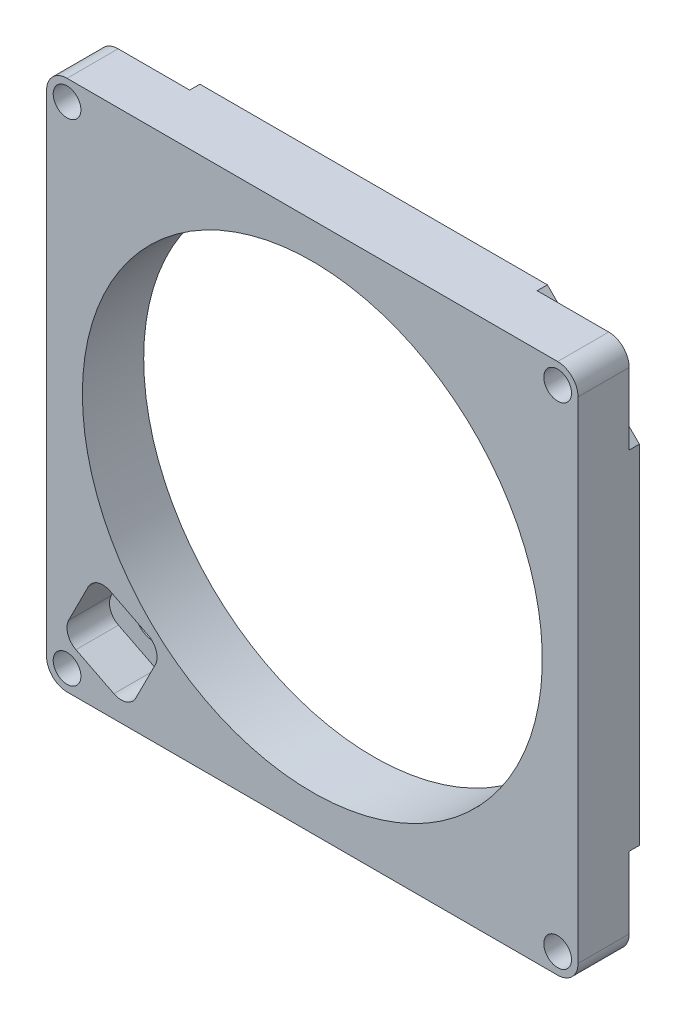
ISO-10303-21;
HEADER;
FILE_DESCRIPTION(('STEP AP214'),'2;1');
FILE_NAME('part.step','',(''),(''),'','','');
FILE_SCHEMA(('AUTOMOTIVE_DESIGN { 1 0 10303 214 1 1 1 1 }'));
ENDSEC;
DATA;
#1=APPLICATION_CONTEXT('core data for automotive mechanical design processes');
#2=APPLICATION_PROTOCOL_DEFINITION('international standard','automotive_design',2000,#1);
#3=PRODUCT_CONTEXT('',#1,'mechanical');
#4=PRODUCT('Part','Part','',(#3));
#5=PRODUCT_RELATED_PRODUCT_CATEGORY('part','',(#4));
#6=PRODUCT_DEFINITION_FORMATION('','',#4);
#7=PRODUCT_DEFINITION_CONTEXT('part definition',#1,'design');
#8=PRODUCT_DEFINITION('design','',#6,#7);
#9=PRODUCT_DEFINITION_SHAPE('','',#8);
#10=(LENGTH_UNIT() NAMED_UNIT(*) SI_UNIT(.MILLI.,.METRE.));
#11=(NAMED_UNIT(*) PLANE_ANGLE_UNIT() SI_UNIT($,.RADIAN.));
#12=(NAMED_UNIT(*) SI_UNIT($,.STERADIAN.) SOLID_ANGLE_UNIT());
#13=UNCERTAINTY_MEASURE_WITH_UNIT(LENGTH_MEASURE(1.E-05),#10,'distance_accuracy_value','');
#14=(GEOMETRIC_REPRESENTATION_CONTEXT(3) GLOBAL_UNCERTAINTY_ASSIGNED_CONTEXT((#13)) GLOBAL_UNIT_ASSIGNED_CONTEXT((#10,
#11,#12)) REPRESENTATION_CONTEXT('',''));
#15=CARTESIAN_POINT('',(0.,0.,0.));
#16=DIRECTION('',(0.,0.,1.));
#17=DIRECTION('',(1.,0.,0.));
#18=AXIS2_PLACEMENT_3D('',#15,#16,#17);
#19=CARTESIAN_POINT('',(-289.401250000614,2436.07197516587,-7.93750000000001));
#20=DIRECTION('',(0.,0.,-1.));
#21=DIRECTION('',(0.,-1.,0.));
#22=AXIS2_PLACEMENT_3D('',#19,#20,#21);
#23=PLANE('',#22);
#24=CARTESIAN_POINT('',(-217.170000000614,2363.84072516588,-7.93750000000001));
#25=DIRECTION('',(0.,0.,-1.));
#26=DIRECTION('',(-1.,0.,0.));
#27=AXIS2_PLACEMENT_3D('',#24,#25,#26);
#28=CIRCLE('',#27,2.15265000000001);
#29=CARTESIAN_POINT('',(-219.322650000614,2363.84072516588,-7.93750000000001));
#30=VERTEX_POINT('',#29);
#31=EDGE_CURVE('E288',#30,#30,#28,.T.);
#32=ORIENTED_EDGE('',*,*,#31,.F.);
#33=EDGE_LOOP('',(#32));
#34=FACE_BOUND('',#33,.T.);
#35=DIRECTION('',(-0.707106781186547,-0.707106781186547,0.));
#36=VECTOR('',#35,1.);
#37=CARTESIAN_POINT('',(-213.995000000614,2374.95322516588,-7.93750000000001));
#38=LINE('',#37,#36);
#39=CARTESIAN_POINT('',(-213.995000000614,2374.95322516588,-7.93750000000001));
#40=VERTEX_POINT('',#39);
#41=CARTESIAN_POINT('',(-228.282500000614,2360.66572516588,-7.93750000000001));
#42=VERTEX_POINT('',#41);
#43=EDGE_CURVE('E305',#40,#42,#38,.T.);
#44=ORIENTED_EDGE('',*,*,#43,.F.);
#45=DIRECTION('',(0.,1.,0.));
#46=VECTOR('',#45,1.);
#47=CARTESIAN_POINT('',(-213.995000000614,2363.84072516588,-7.93750000000001));
#48=LINE('',#47,#46);
#49=CARTESIAN_POINT('',(-213.995000000614,2363.84072516588,-7.93750000000001));
#50=VERTEX_POINT('',#49);
#51=EDGE_CURVE('E377',#50,#40,#48,.T.);
#52=ORIENTED_EDGE('',*,*,#51,.F.);
#53=CARTESIAN_POINT('',(-217.170000000614,2363.84072516588,-7.93750000000001));
#54=DIRECTION('',(0.,0.,-1.));
#55=DIRECTION('',(-1.,0.,0.));
#56=AXIS2_PLACEMENT_3D('',#53,#54,#55);
#57=CIRCLE('',#56,3.17500000000008);
#58=CARTESIAN_POINT('',(-217.170000000614,2360.66572516588,-7.93750000000001));
#59=VERTEX_POINT('',#58);
#60=EDGE_CURVE('E59',#59,#50,#57,.F.);
#61=ORIENTED_EDGE('',*,*,#60,.F.);
#62=DIRECTION('',(1.,0.,0.));
#63=VECTOR('',#62,1.);
#64=CARTESIAN_POINT('',(-293.370000000614,2360.66572516587,-7.93750000000001));
#65=LINE('',#64,#63);
#66=EDGE_CURVE('E401',#42,#59,#65,.T.);
#67=ORIENTED_EDGE('',*,*,#66,.F.);
#68=EDGE_LOOP('',(#44,#52,#61,#67));
#69=FACE_BOUND('',#68,.T.);
#70=ADVANCED_FACE('F50',(#34,#69),#23,.T.);
#71=CARTESIAN_POINT('',(-217.170000000614,2440.04072516588,-7.93750000000001));
#72=DIRECTION('',(0.,0.,-1.));
#73=DIRECTION('',(-1.,0.,0.));
#74=AXIS2_PLACEMENT_3D('',#71,#72,#73);
#75=CIRCLE('',#74,2.15265000000001);
#76=CARTESIAN_POINT('',(-219.322650000614,2440.04072516588,-7.93750000000001));
#77=VERTEX_POINT('',#76);
#78=EDGE_CURVE('E270',#77,#77,#75,.T.);
#79=ORIENTED_EDGE('',*,*,#78,.F.);
#80=EDGE_LOOP('',(#79));
#81=FACE_BOUND('',#80,.T.);
#82=DIRECTION('',(0.707106781186547,-0.707106781186547,0.));
#83=VECTOR('',#82,1.);
#84=CARTESIAN_POINT('',(-228.282500000614,2443.21572516588,-7.93750000000001));
#85=LINE('',#84,#83);
#86=CARTESIAN_POINT('',(-228.282500000614,2443.21572516588,-7.93750000000001));
#87=VERTEX_POINT('',#86);
#88=CARTESIAN_POINT('',(-213.995000000614,2428.92822516588,-7.93750000000001));
#89=VERTEX_POINT('',#88);
#90=EDGE_CURVE('E346',#87,#89,#85,.T.);
#91=ORIENTED_EDGE('',*,*,#90,.F.);
#92=DIRECTION('',(-1.,0.,0.));
#93=VECTOR('',#92,1.);
#94=CARTESIAN_POINT('',(-217.170000000614,2443.21572516588,-7.93750000000001));
#95=LINE('',#94,#93);
#96=CARTESIAN_POINT('',(-217.170000000614,2443.21572516588,-7.93750000000001));
#97=VERTEX_POINT('',#96);
#98=EDGE_CURVE('E384',#97,#87,#95,.T.);
#99=ORIENTED_EDGE('',*,*,#98,.F.);
#100=CARTESIAN_POINT('',(-217.170000000614,2440.04072516588,-7.93750000000001));
#101=DIRECTION('',(0.,0.,-1.));
#102=DIRECTION('',(-1.,0.,0.));
#103=AXIS2_PLACEMENT_3D('',#100,#101,#102);
#104=CIRCLE('',#103,3.17500000000008);
#105=CARTESIAN_POINT('',(-213.995000000614,2440.04072516588,-7.93750000000001));
#106=VERTEX_POINT('',#105);
#107=EDGE_CURVE('E392',#106,#97,#104,.F.);
#108=ORIENTED_EDGE('',*,*,#107,.F.);
#109=EDGE_CURVE('E75',#89,#106,#48,.T.);
#110=ORIENTED_EDGE('',*,*,#109,.F.);
#111=EDGE_LOOP('',(#91,#99,#108,#110));
#112=FACE_BOUND('',#111,.T.);
#113=ADVANCED_FACE('F525',(#81,#112),#23,.T.);
#114=CARTESIAN_POINT('',(-293.370000000614,2440.04072516587,-7.93750000000001));
#115=DIRECTION('',(0.,0.,-1.));
#116=DIRECTION('',(-1.,0.,0.));
#117=AXIS2_PLACEMENT_3D('',#114,#115,#116);
#118=CIRCLE('',#117,2.15264999999998);
#119=CARTESIAN_POINT('',(-295.522650000614,2440.04072516587,-7.93750000000001));
#120=VERTEX_POINT('',#119);
#121=EDGE_CURVE('E276',#120,#120,#118,.T.);
#122=ORIENTED_EDGE('',*,*,#121,.F.);
#123=EDGE_LOOP('',(#122));
#124=FACE_BOUND('',#123,.T.);
#125=DIRECTION('',(0.707106781186547,0.707106781186547,0.));
#126=VECTOR('',#125,1.);
#127=CARTESIAN_POINT('',(-296.545000000614,2428.92822516587,-7.93750000000001));
#128=LINE('',#127,#126);
#129=CARTESIAN_POINT('',(-296.545000000614,2428.92822516587,-7.93750000000001));
#130=VERTEX_POINT('',#129);
#131=CARTESIAN_POINT('',(-282.257500000614,2443.21572516587,-7.93750000000001));
#132=VERTEX_POINT('',#131);
#133=EDGE_CURVE('E328',#130,#132,#128,.T.);
#134=ORIENTED_EDGE('',*,*,#133,.F.);
#135=DIRECTION('',(0.,-1.,0.));
#136=VECTOR('',#135,1.);
#137=CARTESIAN_POINT('',(-296.545000000614,2440.04072516587,-7.93750000000001));
#138=LINE('',#137,#136);
#139=CARTESIAN_POINT('',(-296.545000000614,2440.04072516587,-7.93750000000001));
#140=VERTEX_POINT('',#139);
#141=EDGE_CURVE('E405',#140,#130,#138,.T.);
#142=ORIENTED_EDGE('',*,*,#141,.F.);
#143=CARTESIAN_POINT('',(-293.370000000614,2440.04072516587,-7.93750000000001));
#144=DIRECTION('',(0.,0.,-1.));
#145=DIRECTION('',(-1.,0.,0.));
#146=AXIS2_PLACEMENT_3D('',#143,#144,#145);
#147=CIRCLE('',#146,3.17500000000007);
#148=CARTESIAN_POINT('',(-293.370000000614,2443.21572516587,-7.93750000000001));
#149=VERTEX_POINT('',#148);
#150=EDGE_CURVE('E390',#149,#140,#147,.F.);
#151=ORIENTED_EDGE('',*,*,#150,.F.);
#152=EDGE_CURVE('E381',#132,#149,#95,.T.);
#153=ORIENTED_EDGE('',*,*,#152,.F.);
#154=EDGE_LOOP('',(#134,#142,#151,#153));
#155=FACE_BOUND('',#154,.T.);
#156=ADVANCED_FACE('F448',(#124,#155),#23,.T.);
#157=CARTESIAN_POINT('',(-293.370000000614,2363.84072516587,-7.93750000000001));
#158=DIRECTION('',(0.,0.,-1.));
#159=DIRECTION('',(-1.,0.,0.));
#160=AXIS2_PLACEMENT_3D('',#157,#158,#159);
#161=CIRCLE('',#160,2.15264999999998);
#162=CARTESIAN_POINT('',(-295.522650000614,2363.84072516587,-7.93750000000001));
#163=VERTEX_POINT('',#162);
#164=EDGE_CURVE('E282',#163,#163,#161,.T.);
#165=ORIENTED_EDGE('',*,*,#164,.F.);
#166=EDGE_LOOP('',(#165));
#167=FACE_BOUND('',#166,.T.);
#168=DIRECTION('',(-0.707106781186547,0.707106781186547,0.));
#169=VECTOR('',#168,1.);
#170=CARTESIAN_POINT('',(-282.257500000614,2360.66572516587,-7.93750000000001));
#171=LINE('',#170,#169);
#172=CARTESIAN_POINT('',(-282.257500000614,2360.66572516587,-7.93750000000001));
#173=VERTEX_POINT('',#172);
#174=CARTESIAN_POINT('',(-296.545000000614,2374.95322516587,-7.93750000000001));
#175=VERTEX_POINT('',#174);
#176=EDGE_CURVE('E300',#173,#175,#171,.T.);
#177=ORIENTED_EDGE('',*,*,#176,.F.);
#178=CARTESIAN_POINT('',(-293.370000000614,2360.66572516587,-7.93750000000001));
#179=VERTEX_POINT('',#178);
#180=EDGE_CURVE('E398',#179,#173,#65,.T.);
#181=ORIENTED_EDGE('',*,*,#180,.F.);
#182=CARTESIAN_POINT('',(-293.370000000614,2363.84072516587,-7.93750000000001));
#183=DIRECTION('',(0.,0.,-1.));
#184=DIRECTION('',(-1.,0.,0.));
#185=AXIS2_PLACEMENT_3D('',#182,#183,#184);
#186=CIRCLE('',#185,3.17500000000009);
#187=CARTESIAN_POINT('',(-296.545000000614,2363.84072516587,-7.93750000000001));
#188=VERTEX_POINT('',#187);
#189=EDGE_CURVE('E402',#188,#179,#186,.F.);
#190=ORIENTED_EDGE('',*,*,#189,.F.);
#191=EDGE_CURVE('E408',#175,#188,#138,.T.);
#192=ORIENTED_EDGE('',*,*,#191,.F.);
#193=EDGE_LOOP('',(#177,#181,#190,#192));
#194=FACE_BOUND('',#193,.T.);
#195=ADVANCED_FACE('F52',(#167,#194),#23,.T.);
#196=CARTESIAN_POINT('',(-217.170000000614,2363.84072516588,0.));
#197=DIRECTION('',(0.,0.,1.));
#198=DIRECTION('',(1.,0.,0.));
#199=AXIS2_PLACEMENT_3D('',#196,#197,#198);
#200=PLANE('',#199);
#201=DIRECTION('',(-0.892661280769551,0.450728119618541,0.));
#202=VECTOR('',#201,1.);
#203=CARTESIAN_POINT('',(-280.781011311218,2374.6039927547,0.));
#204=LINE('',#203,#202);
#205=CARTESIAN_POINT('',(-280.781011311218,2374.6039927547,0.));
#206=VERTEX_POINT('',#205);
#207=CARTESIAN_POINT('',(-286.6716693117,2377.57834065247,0.));
#208=VERTEX_POINT('',#207);
#209=EDGE_CURVE('E229',#206,#208,#204,.T.);
#210=ORIENTED_EDGE('',*,*,#209,.F.);
#211=CARTESIAN_POINT('',(-281.925860735049,2372.33663310155,0.));
#212=DIRECTION('',(0.,0.,1.));
#213=DIRECTION('',(1.,0.,0.));
#214=AXIS2_PLACEMENT_3D('',#211,#212,#213);
#215=CIRCLE('',#214,2.5400000000005);
#216=CARTESIAN_POINT('',(-279.658501081894,2371.19178367771,0.));
#217=VERTEX_POINT('',#216);
#218=EDGE_CURVE('E241',#217,#206,#215,.T.);
#219=ORIENTED_EDGE('',*,*,#218,.F.);
#220=DIRECTION('',(0.4507281196185,0.892661280769571,0.));
#221=VECTOR('',#220,1.);
#222=CARTESIAN_POINT('',(-282.686121612545,2365.19561990861,0.));
#223=LINE('',#222,#221);
#224=CARTESIAN_POINT('',(-282.686121612545,2365.19561990861,0.));
#225=VERTEX_POINT('',#224);
#226=EDGE_CURVE('E67',#225,#217,#223,.T.);
#227=ORIENTED_EDGE('',*,*,#226,.F.);
#228=CARTESIAN_POINT('',(-284.953481265701,2366.34046933244,0.));
#229=DIRECTION('',(0.,0.,1.));
#230=DIRECTION('',(-1.,0.,0.));
#231=AXIS2_PLACEMENT_3D('',#228,#229,#230);
#232=CIRCLE('',#231,2.54000000000086);
#233=CARTESIAN_POINT('',(-286.098330689532,2364.07310967928,0.));
#234=VERTEX_POINT('',#233);
#235=EDGE_CURVE('E237',#234,#225,#232,.T.);
#236=ORIENTED_EDGE('',*,*,#235,.F.);
#237=DIRECTION('',(0.892661280769514,-0.450728119618614,0.));
#238=VECTOR('',#237,1.);
#239=CARTESIAN_POINT('',(-286.098330689531,2364.07310967928,0.));
#240=LINE('',#239,#238);
#241=CARTESIAN_POINT('',(-291.988988690014,2367.04745757705,0.));
#242=VERTEX_POINT('',#241);
#243=EDGE_CURVE('E482',#242,#234,#240,.T.);
#244=ORIENTED_EDGE('',*,*,#243,.F.);
#245=CARTESIAN_POINT('',(-290.844139266183,2369.3148172302,0.));
#246=DIRECTION('',(0.,0.,1.));
#247=DIRECTION('',(-1.,0.,0.));
#248=AXIS2_PLACEMENT_3D('',#245,#246,#247);
#249=CIRCLE('',#248,2.54000000000061);
#250=CARTESIAN_POINT('',(-293.111498919338,2370.45966665404,0.));
#251=VERTEX_POINT('',#250);
#252=EDGE_CURVE('E485',#251,#242,#249,.T.);
#253=ORIENTED_EDGE('',*,*,#252,.F.);
#254=DIRECTION('',(-0.450728119618685,-0.892661280769478,0.));
#255=VECTOR('',#254,1.);
#256=CARTESIAN_POINT('',(-293.111498919338,2370.45966665404,0.));
#257=LINE('',#256,#255);
#258=CARTESIAN_POINT('',(-290.083878388686,2376.45583042314,0.));
#259=VERTEX_POINT('',#258);
#260=EDGE_CURVE('E488',#259,#251,#257,.T.);
#261=ORIENTED_EDGE('',*,*,#260,.F.);
#262=CARTESIAN_POINT('',(-287.816518735532,2375.31098099931,0.));
#263=DIRECTION('',(0.,0.,1.));
#264=DIRECTION('',(-1.,0.,0.));
#265=AXIS2_PLACEMENT_3D('',#262,#263,#264);
#266=CIRCLE('',#265,2.54);
#267=EDGE_CURVE('E491',#208,#259,#266,.T.);
#268=ORIENTED_EDGE('',*,*,#267,.F.);
#269=EDGE_LOOP('',(#210,#219,#227,#236,#244,#253,#261,#268));
#270=FACE_BOUND('',#269,.T.);
#271=CARTESIAN_POINT('',(-217.170000000614,2440.04072516588,0.));
#272=DIRECTION('',(0.,0.,-1.));
#273=DIRECTION('',(-1.,0.,0.));
#274=AXIS2_PLACEMENT_3D('',#271,#272,#273);
#275=CIRCLE('',#274,2.15265000000001);
#276=CARTESIAN_POINT('',(-219.322650000614,2440.04072516588,0.));
#277=VERTEX_POINT('',#276);
#278=EDGE_CURVE('E273',#277,#277,#275,.T.);
#279=ORIENTED_EDGE('',*,*,#278,.T.);
#280=EDGE_LOOP('',(#279));
#281=FACE_BOUND('',#280,.T.);
#282=CARTESIAN_POINT('',(-293.370000000614,2440.04072516587,0.));
#283=DIRECTION('',(0.,0.,-1.));
#284=DIRECTION('',(-1.,0.,0.));
#285=AXIS2_PLACEMENT_3D('',#282,#283,#284);
#286=CIRCLE('',#285,2.15264999999998);
#287=CARTESIAN_POINT('',(-295.522650000614,2440.04072516587,0.));
#288=VERTEX_POINT('',#287);
#289=EDGE_CURVE('E279',#288,#288,#286,.T.);
#290=ORIENTED_EDGE('',*,*,#289,.T.);
#291=EDGE_LOOP('',(#290));
#292=FACE_BOUND('',#291,.T.);
#293=CARTESIAN_POINT('',(-293.370000000614,2363.84072516587,0.));
#294=DIRECTION('',(0.,0.,-1.));
#295=DIRECTION('',(-1.,0.,0.));
#296=AXIS2_PLACEMENT_3D('',#293,#294,#295);
#297=CIRCLE('',#296,2.15264999999998);
#298=CARTESIAN_POINT('',(-295.522650000614,2363.84072516587,0.));
#299=VERTEX_POINT('',#298);
#300=EDGE_CURVE('E285',#299,#299,#297,.T.);
#301=ORIENTED_EDGE('',*,*,#300,.T.);
#302=EDGE_LOOP('',(#301));
#303=FACE_BOUND('',#302,.T.);
#304=CARTESIAN_POINT('',(-217.170000000614,2363.84072516588,0.));
#305=DIRECTION('',(0.,0.,-1.));
#306=DIRECTION('',(-1.,0.,0.));
#307=AXIS2_PLACEMENT_3D('',#304,#305,#306);
#308=CIRCLE('',#307,2.15265000000001);
#309=CARTESIAN_POINT('',(-219.322650000614,2363.84072516588,0.));
#310=VERTEX_POINT('',#309);
#311=EDGE_CURVE('E291',#310,#310,#308,.T.);
#312=ORIENTED_EDGE('',*,*,#311,.T.);
#313=EDGE_LOOP('',(#312));
#314=FACE_BOUND('',#313,.T.);
#315=CARTESIAN_POINT('',(-255.270000000614,2401.94072516588,0.));
#316=DIRECTION('',(0.,0.,-1.));
#317=DIRECTION('',(-1.,0.,0.));
#318=AXIS2_PLACEMENT_3D('',#315,#316,#317);
#319=CIRCLE('',#318,35.71875);
#320=CARTESIAN_POINT('',(-290.988750000614,2401.94072516588,0.));
#321=VERTEX_POINT('',#320);
#322=EDGE_CURVE('E294',#321,#321,#319,.T.);
#323=ORIENTED_EDGE('',*,*,#322,.T.);
#324=EDGE_LOOP('',(#323));
#325=FACE_BOUND('',#324,.T.);
#326=CARTESIAN_POINT('',(-217.170000000614,2363.84072516588,0.));
#327=DIRECTION('',(0.,0.,1.));
#328=DIRECTION('',(1.,0.,0.));
#329=AXIS2_PLACEMENT_3D('',#326,#327,#328);
#330=CIRCLE('',#329,3.17500000000008);
#331=CARTESIAN_POINT('',(-217.170000000614,2360.66572516588,0.));
#332=VERTEX_POINT('',#331);
#333=CARTESIAN_POINT('',(-213.995000000614,2363.84072516588,0.));
#334=VERTEX_POINT('',#333);
#335=EDGE_CURVE('E340',#332,#334,#330,.T.);
#336=ORIENTED_EDGE('',*,*,#335,.T.);
#337=DIRECTION('',(0.,1.,0.));
#338=VECTOR('',#337,1.);
#339=CARTESIAN_POINT('',(-213.995000000614,2363.84072516588,0.));
#340=LINE('',#339,#338);
#341=CARTESIAN_POINT('',(-213.995000000614,2440.04072516588,0.));
#342=VERTEX_POINT('',#341);
#343=EDGE_CURVE('E369',#334,#342,#340,.T.);
#344=ORIENTED_EDGE('',*,*,#343,.T.);
#345=CARTESIAN_POINT('',(-217.170000000614,2440.04072516588,0.));
#346=DIRECTION('',(0.,0.,1.));
#347=DIRECTION('',(1.,0.,0.));
#348=AXIS2_PLACEMENT_3D('',#345,#346,#347);
#349=CIRCLE('',#348,3.17500000000008);
#350=CARTESIAN_POINT('',(-217.170000000614,2443.21572516588,0.));
#351=VERTEX_POINT('',#350);
#352=EDGE_CURVE('E366',#342,#351,#349,.T.);
#353=ORIENTED_EDGE('',*,*,#352,.T.);
#354=DIRECTION('',(-1.,0.,0.));
#355=VECTOR('',#354,1.);
#356=CARTESIAN_POINT('',(-217.170000000614,2443.21572516588,0.));
#357=LINE('',#356,#355);
#358=CARTESIAN_POINT('',(-293.370000000614,2443.21572516587,0.));
#359=VERTEX_POINT('',#358);
#360=EDGE_CURVE('E363',#351,#359,#357,.T.);
#361=ORIENTED_EDGE('',*,*,#360,.T.);
#362=CARTESIAN_POINT('',(-293.370000000614,2440.04072516587,0.));
#363=DIRECTION('',(0.,0.,1.));
#364=DIRECTION('',(1.,0.,0.));
#365=AXIS2_PLACEMENT_3D('',#362,#363,#364);
#366=CIRCLE('',#365,3.17500000000007);
#367=CARTESIAN_POINT('',(-296.545000000614,2440.04072516587,0.));
#368=VERTEX_POINT('',#367);
#369=EDGE_CURVE('E360',#359,#368,#366,.T.);
#370=ORIENTED_EDGE('',*,*,#369,.T.);
#371=DIRECTION('',(0.,-1.,0.));
#372=VECTOR('',#371,1.);
#373=CARTESIAN_POINT('',(-296.545000000614,2440.04072516587,0.));
#374=LINE('',#373,#372);
#375=CARTESIAN_POINT('',(-296.545000000614,2363.84072516587,0.));
#376=VERTEX_POINT('',#375);
#377=EDGE_CURVE('E357',#368,#376,#374,.T.);
#378=ORIENTED_EDGE('',*,*,#377,.T.);
#379=CARTESIAN_POINT('',(-293.370000000614,2363.84072516587,0.));
#380=DIRECTION('',(0.,0.,1.));
#381=DIRECTION('',(1.,0.,0.));
#382=AXIS2_PLACEMENT_3D('',#379,#380,#381);
#383=CIRCLE('',#382,3.17500000000009);
#384=CARTESIAN_POINT('',(-293.370000000614,2360.66572516587,0.));
#385=VERTEX_POINT('',#384);
#386=EDGE_CURVE('E354',#376,#385,#383,.T.);
#387=ORIENTED_EDGE('',*,*,#386,.T.);
#388=DIRECTION('',(1.,0.,0.));
#389=VECTOR('',#388,1.);
#390=CARTESIAN_POINT('',(-293.370000000614,2360.66572516587,0.));
#391=LINE('',#390,#389);
#392=EDGE_CURVE('E351',#385,#332,#391,.T.);
#393=ORIENTED_EDGE('',*,*,#392,.T.);
#394=EDGE_LOOP('',(#336,#344,#353,#361,#370,#378,#387,#393));
#395=FACE_BOUND('',#394,.T.);
#396=ADVANCED_FACE('F440',(#270,#281,#292,#303,#314,#325,#395),#200,.T.);
#397=CARTESIAN_POINT('',(-213.995000000614,2363.84072516588,-124.680829573899));
#398=DIRECTION('',(1.,0.,0.));
#399=DIRECTION('',(0.,0.,-1.));
#400=AXIS2_PLACEMENT_3D('',#397,#398,#399);
#401=PLANE('',#400);
#402=DIRECTION('',(0.,0.,1.));
#403=VECTOR('',#402,1.);
#404=CARTESIAN_POINT('',(-213.995000000614,2363.84072516588,-124.680829573899));
#405=LINE('',#404,#403);
#406=EDGE_CURVE('E14',#50,#334,#405,.T.);
#407=ORIENTED_EDGE('',*,*,#406,.F.);
#408=ORIENTED_EDGE('',*,*,#51,.T.);
#409=DIRECTION('',(0.,0.,1.));
#410=VECTOR('',#409,1.);
#411=CARTESIAN_POINT('',(-213.995000000614,2374.95322516588,-9.52500000000001));
#412=LINE('',#411,#410);
#413=CARTESIAN_POINT('',(-213.995000000614,2374.95322516588,-9.52500000000001));
#414=VERTEX_POINT('',#413);
#415=EDGE_CURVE('E622',#414,#40,#412,.T.);
#416=ORIENTED_EDGE('',*,*,#415,.F.);
#417=DIRECTION('',(0.,-1.,0.));
#418=VECTOR('',#417,1.);
#419=CARTESIAN_POINT('',(-213.995000000614,2428.92822516588,-9.52500000000001));
#420=LINE('',#419,#418);
#421=CARTESIAN_POINT('',(-213.995000000614,2428.92822516588,-9.52500000000001));
#422=VERTEX_POINT('',#421);
#423=EDGE_CURVE('E315',#422,#414,#420,.T.);
#424=ORIENTED_EDGE('',*,*,#423,.F.);
#425=DIRECTION('',(0.,0.,1.));
#426=VECTOR('',#425,1.);
#427=CARTESIAN_POINT('',(-213.995000000614,2428.92822516588,-9.52500000000001));
#428=LINE('',#427,#426);
#429=EDGE_CURVE('E624',#422,#89,#428,.T.);
#430=ORIENTED_EDGE('',*,*,#429,.T.);
#431=ORIENTED_EDGE('',*,*,#109,.T.);
#432=DIRECTION('',(0.,0.,1.));
#433=VECTOR('',#432,1.);
#434=CARTESIAN_POINT('',(-213.995000000614,2440.04072516588,-124.680829573899));
#435=LINE('',#434,#433);
#436=EDGE_CURVE('E380',#106,#342,#435,.T.);
#437=ORIENTED_EDGE('',*,*,#436,.T.);
#438=ORIENTED_EDGE('',*,*,#343,.F.);
#439=EDGE_LOOP('',(#407,#408,#416,#424,#430,#431,#437,#438));
#440=FACE_BOUND('',#439,.T.);
#441=ADVANCED_FACE('F539',(#440),#401,.T.);
#442=CARTESIAN_POINT('',(-217.170000000614,2440.04072516588,-124.680829573899));
#443=DIRECTION('',(0.,0.,1.));
#444=DIRECTION('',(1.,0.,0.));
#445=AXIS2_PLACEMENT_3D('',#442,#443,#444);
#446=CYLINDRICAL_SURFACE('',#445,3.17500000000008);
#447=ORIENTED_EDGE('',*,*,#436,.F.);
#448=ORIENTED_EDGE('',*,*,#107,.T.);
#449=DIRECTION('',(0.,0.,1.));
#450=VECTOR('',#449,1.);
#451=CARTESIAN_POINT('',(-217.170000000614,2443.21572516588,-124.680829573899));
#452=LINE('',#451,#450);
#453=EDGE_CURVE('E385',#97,#351,#452,.T.);
#454=ORIENTED_EDGE('',*,*,#453,.T.);
#455=ORIENTED_EDGE('',*,*,#352,.F.);
#456=EDGE_LOOP('',(#447,#448,#454,#455));
#457=FACE_BOUND('',#456,.T.);
#458=ADVANCED_FACE('F602',(#457),#446,.T.);
#459=CARTESIAN_POINT('',(-217.170000000614,2443.21572516588,-124.680829573899));
#460=DIRECTION('',(0.,1.,0.));
#461=DIRECTION('',(0.,0.,1.));
#462=AXIS2_PLACEMENT_3D('',#459,#460,#461);
#463=PLANE('',#462);
#464=ORIENTED_EDGE('',*,*,#453,.F.);
#465=ORIENTED_EDGE('',*,*,#98,.T.);
#466=DIRECTION('',(0.,0.,1.));
#467=VECTOR('',#466,1.);
#468=CARTESIAN_POINT('',(-228.282500000614,2443.21572516588,-9.52500000000001));
#469=LINE('',#468,#467);
#470=CARTESIAN_POINT('',(-228.282500000614,2443.21572516588,-9.52500000000001));
#471=VERTEX_POINT('',#470);
#472=EDGE_CURVE('E461',#471,#87,#469,.T.);
#473=ORIENTED_EDGE('',*,*,#472,.F.);
#474=DIRECTION('',(1.,0.,0.));
#475=VECTOR('',#474,1.);
#476=CARTESIAN_POINT('',(-282.257500000614,2443.21572516587,-9.52500000000001));
#477=LINE('',#476,#475);
#478=CARTESIAN_POINT('',(-282.257500000614,2443.21572516587,-9.52500000000001));
#479=VERTEX_POINT('',#478);
#480=EDGE_CURVE('E311',#479,#471,#477,.T.);
#481=ORIENTED_EDGE('',*,*,#480,.F.);
#482=DIRECTION('',(0.,0.,1.));
#483=VECTOR('',#482,1.);
#484=CARTESIAN_POINT('',(-282.257500000614,2443.21572516587,-9.52500000000001));
#485=LINE('',#484,#483);
#486=EDGE_CURVE('E459',#479,#132,#485,.T.);
#487=ORIENTED_EDGE('',*,*,#486,.T.);
#488=ORIENTED_EDGE('',*,*,#152,.T.);
#489=DIRECTION('',(0.,0.,1.));
#490=VECTOR('',#489,1.);
#491=CARTESIAN_POINT('',(-293.370000000614,2443.21572516587,-124.680829573899));
#492=LINE('',#491,#490);
#493=EDGE_CURVE('E409',#149,#359,#492,.T.);
#494=ORIENTED_EDGE('',*,*,#493,.T.);
#495=ORIENTED_EDGE('',*,*,#360,.F.);
#496=EDGE_LOOP('',(#464,#465,#473,#481,#487,#488,#494,#495));
#497=FACE_BOUND('',#496,.T.);
#498=ADVANCED_FACE('F599',(#497),#463,.T.);
#499=CARTESIAN_POINT('',(-293.370000000614,2440.04072516587,-124.680829573899));
#500=DIRECTION('',(0.,0.,1.));
#501=DIRECTION('',(1.,0.,0.));
#502=AXIS2_PLACEMENT_3D('',#499,#500,#501);
#503=CYLINDRICAL_SURFACE('',#502,3.17500000000007);
#504=ORIENTED_EDGE('',*,*,#493,.F.);
#505=ORIENTED_EDGE('',*,*,#150,.T.);
#506=DIRECTION('',(0.,0.,1.));
#507=VECTOR('',#506,1.);
#508=CARTESIAN_POINT('',(-296.545000000614,2440.04072516587,-124.680829573899));
#509=LINE('',#508,#507);
#510=EDGE_CURVE('E406',#140,#368,#509,.T.);
#511=ORIENTED_EDGE('',*,*,#510,.T.);
#512=ORIENTED_EDGE('',*,*,#369,.F.);
#513=EDGE_LOOP('',(#504,#505,#511,#512));
#514=FACE_BOUND('',#513,.T.);
#515=ADVANCED_FACE('F446',(#514),#503,.T.);
#516=CARTESIAN_POINT('',(-296.545000000614,2440.04072516587,-124.680829573899));
#517=DIRECTION('',(-1.,0.,0.));
#518=DIRECTION('',(0.,0.,1.));
#519=AXIS2_PLACEMENT_3D('',#516,#517,#518);
#520=PLANE('',#519);
#521=ORIENTED_EDGE('',*,*,#510,.F.);
#522=ORIENTED_EDGE('',*,*,#141,.T.);
#523=DIRECTION('',(0.,0.,1.));
#524=VECTOR('',#523,1.);
#525=CARTESIAN_POINT('',(-296.545000000614,2428.92822516587,-9.52500000000001));
#526=LINE('',#525,#524);
#527=CARTESIAN_POINT('',(-296.545000000614,2428.92822516587,-9.52500000000001));
#528=VERTEX_POINT('',#527);
#529=EDGE_CURVE('E335',#528,#130,#526,.T.);
#530=ORIENTED_EDGE('',*,*,#529,.F.);
#531=DIRECTION('',(0.,1.,0.));
#532=VECTOR('',#531,1.);
#533=CARTESIAN_POINT('',(-296.545000000614,2374.95322516587,-9.52500000000001));
#534=LINE('',#533,#532);
#535=CARTESIAN_POINT('',(-296.545000000614,2374.95322516587,-9.52500000000001));
#536=VERTEX_POINT('',#535);
#537=EDGE_CURVE('E307',#536,#528,#534,.T.);
#538=ORIENTED_EDGE('',*,*,#537,.F.);
#539=DIRECTION('',(0.,0.,1.));
#540=VECTOR('',#539,1.);
#541=CARTESIAN_POINT('',(-296.545000000614,2374.95322516587,-9.52500000000001));
#542=LINE('',#541,#540);
#543=EDGE_CURVE('E331',#536,#175,#542,.T.);
#544=ORIENTED_EDGE('',*,*,#543,.T.);
#545=ORIENTED_EDGE('',*,*,#191,.T.);
#546=DIRECTION('',(0.,0.,1.));
#547=VECTOR('',#546,1.);
#548=CARTESIAN_POINT('',(-296.545000000614,2363.84072516587,-124.680829573899));
#549=LINE('',#548,#547);
#550=EDGE_CURVE('E403',#188,#376,#549,.T.);
#551=ORIENTED_EDGE('',*,*,#550,.T.);
#552=ORIENTED_EDGE('',*,*,#377,.F.);
#553=EDGE_LOOP('',(#521,#522,#530,#538,#544,#545,#551,#552));
#554=FACE_BOUND('',#553,.T.);
#555=ADVANCED_FACE('F428',(#554),#520,.T.);
#556=CARTESIAN_POINT('',(-293.370000000614,2363.84072516587,-124.680829573899));
#557=DIRECTION('',(0.,0.,1.));
#558=DIRECTION('',(1.,0.,0.));
#559=AXIS2_PLACEMENT_3D('',#556,#557,#558);
#560=CYLINDRICAL_SURFACE('',#559,3.17500000000009);
#561=ORIENTED_EDGE('',*,*,#550,.F.);
#562=ORIENTED_EDGE('',*,*,#189,.T.);
#563=DIRECTION('',(0.,0.,1.));
#564=VECTOR('',#563,1.);
#565=CARTESIAN_POINT('',(-293.370000000614,2360.66572516587,-124.680829573899));
#566=LINE('',#565,#564);
#567=EDGE_CURVE('E399',#179,#385,#566,.T.);
#568=ORIENTED_EDGE('',*,*,#567,.T.);
#569=ORIENTED_EDGE('',*,*,#386,.F.);
#570=EDGE_LOOP('',(#561,#562,#568,#569));
#571=FACE_BOUND('',#570,.T.);
#572=ADVANCED_FACE('F437',(#571),#560,.T.);
#573=CARTESIAN_POINT('',(-293.370000000614,2360.66572516587,-124.680829573899));
#574=DIRECTION('',(0.,-1.,0.));
#575=DIRECTION('',(0.,0.,-1.));
#576=AXIS2_PLACEMENT_3D('',#573,#574,#575);
#577=PLANE('',#576);
#578=ORIENTED_EDGE('',*,*,#567,.F.);
#579=ORIENTED_EDGE('',*,*,#180,.T.);
#580=DIRECTION('',(0.,0.,1.));
#581=VECTOR('',#580,1.);
#582=CARTESIAN_POINT('',(-282.257500000614,2360.66572516587,-9.52500000000001));
#583=LINE('',#582,#581);
#584=CARTESIAN_POINT('',(-282.257500000614,2360.66572516587,-9.52500000000001));
#585=VERTEX_POINT('',#584);
#586=EDGE_CURVE('E334',#585,#173,#583,.T.);
#587=ORIENTED_EDGE('',*,*,#586,.F.);
#588=DIRECTION('',(-1.,0.,0.));
#589=VECTOR('',#588,1.);
#590=CARTESIAN_POINT('',(-228.282500000614,2360.66572516588,-9.52500000000001));
#591=LINE('',#590,#589);
#592=CARTESIAN_POINT('',(-228.282500000614,2360.66572516588,-9.52500000000001));
#593=VERTEX_POINT('',#592);
#594=EDGE_CURVE('E301',#593,#585,#591,.T.);
#595=ORIENTED_EDGE('',*,*,#594,.F.);
#596=DIRECTION('',(0.,0.,1.));
#597=VECTOR('',#596,1.);
#598=CARTESIAN_POINT('',(-228.282500000614,2360.66572516588,-9.52500000000001));
#599=LINE('',#598,#597);
#600=EDGE_CURVE('E319',#593,#42,#599,.T.);
#601=ORIENTED_EDGE('',*,*,#600,.T.);
#602=ORIENTED_EDGE('',*,*,#66,.T.);
#603=DIRECTION('',(0.,0.,1.));
#604=VECTOR('',#603,1.);
#605=CARTESIAN_POINT('',(-217.170000000614,2360.66572516588,-124.680829573899));
#606=LINE('',#605,#604);
#607=EDGE_CURVE('E396',#59,#332,#606,.T.);
#608=ORIENTED_EDGE('',*,*,#607,.T.);
#609=ORIENTED_EDGE('',*,*,#392,.F.);
#610=EDGE_LOOP('',(#578,#579,#587,#595,#601,#602,#608,#609));
#611=FACE_BOUND('',#610,.T.);
#612=ADVANCED_FACE('F588',(#611),#577,.T.);
#613=CARTESIAN_POINT('',(-217.170000000614,2363.84072516588,-124.680829573899));
#614=DIRECTION('',(0.,0.,1.));
#615=DIRECTION('',(1.,0.,0.));
#616=AXIS2_PLACEMENT_3D('',#613,#614,#615);
#617=CYLINDRICAL_SURFACE('',#616,3.17500000000008);
#618=ORIENTED_EDGE('',*,*,#607,.F.);
#619=ORIENTED_EDGE('',*,*,#60,.T.);
#620=ORIENTED_EDGE('',*,*,#406,.T.);
#621=ORIENTED_EDGE('',*,*,#335,.F.);
#622=EDGE_LOOP('',(#618,#619,#620,#621));
#623=FACE_BOUND('',#622,.T.);
#624=ADVANCED_FACE('F571',(#623),#617,.T.);
#625=CARTESIAN_POINT('',(0.,0.,-9.52500000000001));
#626=DIRECTION('',(0.,0.,-1.));
#627=DIRECTION('',(-1.,0.,0.));
#628=AXIS2_PLACEMENT_3D('',#625,#626,#627);
#629=PLANE('',#628);
#630=CARTESIAN_POINT('',(-290.619894525597,2373.00450340431,-9.52500000000001));
#631=DIRECTION('',(0.,0.,-1.));
#632=DIRECTION('',(-1.,0.,0.));
#633=AXIS2_PLACEMENT_3D('',#630,#631,#632);
#634=CIRCLE('',#633,0.850899999999988);
#635=CARTESIAN_POINT('',(-291.470794525597,2373.00450340431,-9.52500000000001));
#636=VERTEX_POINT('',#635);
#637=EDGE_CURVE('E477',#636,#636,#634,.T.);
#638=ORIENTED_EDGE('',*,*,#637,.F.);
#639=EDGE_LOOP('',(#638));
#640=FACE_BOUND('',#639,.T.);
#641=CARTESIAN_POINT('',(-286.385000000616,2370.82572516587,-9.52500000000001));
#642=DIRECTION('',(0.,0.,-1.));
#643=DIRECTION('',(-1.,0.,0.));
#644=AXIS2_PLACEMENT_3D('',#641,#642,#643);
#645=CIRCLE('',#644,3.26389999999999);
#646=CARTESIAN_POINT('',(-289.648900000616,2370.82572516587,-9.52500000000001));
#647=VERTEX_POINT('',#646);
#648=EDGE_CURVE('E468',#647,#647,#645,.T.);
#649=ORIENTED_EDGE('',*,*,#648,.F.);
#650=EDGE_LOOP('',(#649));
#651=FACE_BOUND('',#650,.T.);
#652=ORIENTED_EDGE('',*,*,#594,.T.);
#653=DIRECTION('',(-0.707106781186547,0.707106781186547,0.));
#654=VECTOR('',#653,1.);
#655=CARTESIAN_POINT('',(-282.257500000614,2360.66572516587,-9.52500000000001));
#656=LINE('',#655,#654);
#657=EDGE_CURVE('E304',#585,#536,#656,.T.);
#658=ORIENTED_EDGE('',*,*,#657,.T.);
#659=ORIENTED_EDGE('',*,*,#537,.T.);
#660=DIRECTION('',(0.707106781186547,0.707106781186547,0.));
#661=VECTOR('',#660,1.);
#662=CARTESIAN_POINT('',(-296.545000000614,2428.92822516587,-9.52500000000001));
#663=LINE('',#662,#661);
#664=EDGE_CURVE('E309',#528,#479,#663,.T.);
#665=ORIENTED_EDGE('',*,*,#664,.T.);
#666=ORIENTED_EDGE('',*,*,#480,.T.);
#667=DIRECTION('',(0.707106781186547,-0.707106781186547,0.));
#668=VECTOR('',#667,1.);
#669=CARTESIAN_POINT('',(-228.282500000614,2443.21572516588,-9.52500000000001));
#670=LINE('',#669,#668);
#671=EDGE_CURVE('E313',#471,#422,#670,.T.);
#672=ORIENTED_EDGE('',*,*,#671,.T.);
#673=ORIENTED_EDGE('',*,*,#423,.T.);
#674=DIRECTION('',(-0.707106781186547,-0.707106781186547,0.));
#675=VECTOR('',#674,1.);
#676=CARTESIAN_POINT('',(-213.995000000614,2374.95322516588,-9.52500000000001));
#677=LINE('',#676,#675);
#678=EDGE_CURVE('E317',#414,#593,#677,.T.);
#679=ORIENTED_EDGE('',*,*,#678,.T.);
#680=EDGE_LOOP('',(#652,#658,#659,#665,#666,#672,#673,#679));
#681=FACE_BOUND('',#680,.T.);
#682=CARTESIAN_POINT('',(-255.270000000614,2401.94072516588,-9.52500000000001));
#683=DIRECTION('',(0.,0.,-1.));
#684=DIRECTION('',(-1.,0.,0.));
#685=AXIS2_PLACEMENT_3D('',#682,#683,#684);
#686=CIRCLE('',#685,35.71875);
#687=CARTESIAN_POINT('',(-290.988750000614,2401.94072516588,-9.52500000000001));
#688=VERTEX_POINT('',#687);
#689=EDGE_CURVE('E297',#688,#688,#686,.T.);
#690=ORIENTED_EDGE('',*,*,#689,.F.);
#691=EDGE_LOOP('',(#690));
#692=FACE_BOUND('',#691,.T.);
#693=ADVANCED_FACE('F567',(#640,#651,#681,#692),#629,.T.);
#694=CARTESIAN_POINT('',(-282.257500000614,2360.66572516587,-9.52500000000001));
#695=DIRECTION('',(0.707106781186548,0.707106781186548,0.));
#696=DIRECTION('',(-0.707106781186548,0.707106781186548,0.));
#697=AXIS2_PLACEMENT_3D('',#694,#695,#696);
#698=PLANE('',#697);
#699=ORIENTED_EDGE('',*,*,#176,.T.);
#700=ORIENTED_EDGE('',*,*,#543,.F.);
#701=ORIENTED_EDGE('',*,*,#657,.F.);
#702=ORIENTED_EDGE('',*,*,#586,.T.);
#703=EDGE_LOOP('',(#699,#700,#701,#702));
#704=FACE_BOUND('',#703,.T.);
#705=ADVANCED_FACE('F570',(#704),#698,.F.);
#706=CARTESIAN_POINT('',(-296.545000000614,2428.92822516587,-9.52500000000001));
#707=DIRECTION('',(0.707106781186548,-0.707106781186548,0.));
#708=DIRECTION('',(0.707106781186548,0.707106781186548,0.));
#709=AXIS2_PLACEMENT_3D('',#706,#707,#708);
#710=PLANE('',#709);
#711=ORIENTED_EDGE('',*,*,#133,.T.);
#712=ORIENTED_EDGE('',*,*,#486,.F.);
#713=ORIENTED_EDGE('',*,*,#664,.F.);
#714=ORIENTED_EDGE('',*,*,#529,.T.);
#715=EDGE_LOOP('',(#711,#712,#713,#714));
#716=FACE_BOUND('',#715,.T.);
#717=ADVANCED_FACE('F579',(#716),#710,.F.);
#718=CARTESIAN_POINT('',(-228.282500000614,2443.21572516588,-9.52500000000001));
#719=DIRECTION('',(-0.707106781186548,-0.707106781186548,0.));
#720=DIRECTION('',(0.707106781186548,-0.707106781186548,0.));
#721=AXIS2_PLACEMENT_3D('',#718,#719,#720);
#722=PLANE('',#721);
#723=ORIENTED_EDGE('',*,*,#90,.T.);
#724=ORIENTED_EDGE('',*,*,#429,.F.);
#725=ORIENTED_EDGE('',*,*,#671,.F.);
#726=ORIENTED_EDGE('',*,*,#472,.T.);
#727=EDGE_LOOP('',(#723,#724,#725,#726));
#728=FACE_BOUND('',#727,.T.);
#729=ADVANCED_FACE('F575',(#728),#722,.F.);
#730=CARTESIAN_POINT('',(-213.995000000614,2374.95322516588,-9.52500000000001));
#731=DIRECTION('',(-0.707106781186548,0.707106781186548,0.));
#732=DIRECTION('',(-0.707106781186548,-0.707106781186548,0.));
#733=AXIS2_PLACEMENT_3D('',#730,#731,#732);
#734=PLANE('',#733);
#735=ORIENTED_EDGE('',*,*,#43,.T.);
#736=ORIENTED_EDGE('',*,*,#600,.F.);
#737=ORIENTED_EDGE('',*,*,#678,.F.);
#738=ORIENTED_EDGE('',*,*,#415,.T.);
#739=EDGE_LOOP('',(#735,#736,#737,#738));
#740=FACE_BOUND('',#739,.T.);
#741=ADVANCED_FACE('F565',(#740),#734,.F.);
#742=CARTESIAN_POINT('',(-255.270000000614,2401.94072516588,-9.52500000000001));
#743=DIRECTION('',(0.,0.,1.));
#744=DIRECTION('',(1.,0.,0.));
#745=AXIS2_PLACEMENT_3D('',#742,#743,#744);
#746=CYLINDRICAL_SURFACE('',#745,35.71875);
#747=ORIENTED_EDGE('',*,*,#689,.T.);
#748=EDGE_LOOP('',(#747));
#749=FACE_BOUND('',#748,.T.);
#750=ORIENTED_EDGE('',*,*,#322,.F.);
#751=EDGE_LOOP('',(#750));
#752=FACE_BOUND('',#751,.T.);
#753=ADVANCED_FACE('F557',(#749,#752),#746,.F.);
#754=CARTESIAN_POINT('',(-217.170000000614,2363.84072516588,-7.93750000000001));
#755=DIRECTION('',(0.,0.,-1.));
#756=DIRECTION('',(-1.,0.,0.));
#757=AXIS2_PLACEMENT_3D('',#754,#755,#756);
#758=CYLINDRICAL_SURFACE('',#757,2.15265000000001);
#759=ORIENTED_EDGE('',*,*,#311,.F.);
#760=EDGE_LOOP('',(#759));
#761=FACE_BOUND('',#760,.T.);
#762=ORIENTED_EDGE('',*,*,#31,.T.);
#763=EDGE_LOOP('',(#762));
#764=FACE_BOUND('',#763,.T.);
#765=ADVANCED_FACE('F547',(#761,#764),#758,.F.);
#766=CARTESIAN_POINT('',(-293.370000000614,2363.84072516587,-7.93750000000001));
#767=DIRECTION('',(0.,0.,-1.));
#768=DIRECTION('',(-1.,0.,0.));
#769=AXIS2_PLACEMENT_3D('',#766,#767,#768);
#770=CYLINDRICAL_SURFACE('',#769,2.15264999999998);
#771=ORIENTED_EDGE('',*,*,#300,.F.);
#772=EDGE_LOOP('',(#771));
#773=FACE_BOUND('',#772,.T.);
#774=ORIENTED_EDGE('',*,*,#164,.T.);
#775=EDGE_LOOP('',(#774));
#776=FACE_BOUND('',#775,.T.);
#777=ADVANCED_FACE('F544',(#773,#776),#770,.F.);
#778=CARTESIAN_POINT('',(-293.370000000614,2440.04072516587,-7.93750000000001));
#779=DIRECTION('',(0.,0.,-1.));
#780=DIRECTION('',(-1.,0.,0.));
#781=AXIS2_PLACEMENT_3D('',#778,#779,#780);
#782=CYLINDRICAL_SURFACE('',#781,2.15264999999998);
#783=ORIENTED_EDGE('',*,*,#289,.F.);
#784=EDGE_LOOP('',(#783));
#785=FACE_BOUND('',#784,.T.);
#786=ORIENTED_EDGE('',*,*,#121,.T.);
#787=EDGE_LOOP('',(#786));
#788=FACE_BOUND('',#787,.T.);
#789=ADVANCED_FACE('F546',(#785,#788),#782,.F.);
#790=CARTESIAN_POINT('',(-217.170000000614,2440.04072516588,-7.93750000000001));
#791=DIRECTION('',(0.,0.,-1.));
#792=DIRECTION('',(-1.,0.,0.));
#793=AXIS2_PLACEMENT_3D('',#790,#791,#792);
#794=CYLINDRICAL_SURFACE('',#793,2.15265000000001);
#795=ORIENTED_EDGE('',*,*,#278,.F.);
#796=EDGE_LOOP('',(#795));
#797=FACE_BOUND('',#796,.T.);
#798=ORIENTED_EDGE('',*,*,#78,.T.);
#799=EDGE_LOOP('',(#798));
#800=FACE_BOUND('',#799,.T.);
#801=ADVANCED_FACE('F554',(#797,#800),#794,.F.);
#802=CARTESIAN_POINT('',(0.,0.,-6.604));
#803=DIRECTION('',(0.,0.,-1.));
#804=DIRECTION('',(-1.,0.,0.));
#805=AXIS2_PLACEMENT_3D('',#802,#803,#804);
#806=PLANE('',#805);
#807=CARTESIAN_POINT('',(-290.619894525597,2373.00450340431,-6.604));
#808=DIRECTION('',(0.,0.,-1.));
#809=DIRECTION('',(-1.,0.,0.));
#810=AXIS2_PLACEMENT_3D('',#807,#808,#809);
#811=CIRCLE('',#810,0.850899999999988);
#812=CARTESIAN_POINT('',(-291.470794525597,2373.00450340431,-6.604));
#813=VERTEX_POINT('',#812);
#814=EDGE_CURVE('E54',#813,#813,#811,.T.);
#815=ORIENTED_EDGE('',*,*,#814,.T.);
#816=EDGE_LOOP('',(#815));
#817=FACE_BOUND('',#816,.T.);
#818=CARTESIAN_POINT('',(-286.385000000616,2370.82572516587,-6.604));
#819=DIRECTION('',(0.,0.,-1.));
#820=DIRECTION('',(-1.,0.,0.));
#821=AXIS2_PLACEMENT_3D('',#818,#819,#820);
#822=CIRCLE('',#821,3.26389999999999);
#823=CARTESIAN_POINT('',(-289.648900000616,2370.82572516587,-6.604));
#824=VERTEX_POINT('',#823);
#825=EDGE_CURVE('E466',#824,#824,#822,.T.);
#826=ORIENTED_EDGE('',*,*,#825,.T.);
#827=EDGE_LOOP('',(#826));
#828=FACE_BOUND('',#827,.T.);
#829=CARTESIAN_POINT('',(-281.925860735049,2372.33663310155,-6.604));
#830=DIRECTION('',(0.,0.,-1.));
#831=DIRECTION('',(-1.,0.,0.));
#832=AXIS2_PLACEMENT_3D('',#829,#830,#831);
#833=CIRCLE('',#832,2.5400000000005);
#834=CARTESIAN_POINT('',(-279.658501081894,2371.19178367771,-6.604));
#835=VERTEX_POINT('',#834);
#836=CARTESIAN_POINT('',(-280.781011311218,2374.6039927547,-6.604));
#837=VERTEX_POINT('',#836);
#838=EDGE_CURVE('E234',#835,#837,#833,.F.);
#839=ORIENTED_EDGE('',*,*,#838,.T.);
#840=DIRECTION('',(-0.892661280769551,0.450728119618541,0.));
#841=VECTOR('',#840,1.);
#842=CARTESIAN_POINT('',(-280.781011311218,2374.6039927547,-6.604));
#843=LINE('',#842,#841);
#844=CARTESIAN_POINT('',(-286.6716693117,2377.57834065247,-6.604));
#845=VERTEX_POINT('',#844);
#846=EDGE_CURVE('E226',#837,#845,#843,.T.);
#847=ORIENTED_EDGE('',*,*,#846,.T.);
#848=CARTESIAN_POINT('',(-287.816518735532,2375.31098099931,-6.604));
#849=DIRECTION('',(0.,0.,-1.));
#850=DIRECTION('',(-1.,0.,0.));
#851=AXIS2_PLACEMENT_3D('',#848,#849,#850);
#852=CIRCLE('',#851,2.54);
#853=CARTESIAN_POINT('',(-290.083878388686,2376.45583042314,-6.604));
#854=VERTEX_POINT('',#853);
#855=EDGE_CURVE('E213',#845,#854,#852,.F.);
#856=ORIENTED_EDGE('',*,*,#855,.T.);
#857=DIRECTION('',(-0.450728119618685,-0.892661280769478,0.));
#858=VECTOR('',#857,1.);
#859=CARTESIAN_POINT('',(-293.111498919338,2370.45966665404,-6.604));
#860=LINE('',#859,#858);
#861=CARTESIAN_POINT('',(-293.111498919338,2370.45966665404,-6.604));
#862=VERTEX_POINT('',#861);
#863=EDGE_CURVE('E261',#854,#862,#860,.T.);
#864=ORIENTED_EDGE('',*,*,#863,.T.);
#865=CARTESIAN_POINT('',(-290.844139266183,2369.3148172302,-6.604));
#866=DIRECTION('',(0.,0.,-1.));
#867=DIRECTION('',(-1.,0.,0.));
#868=AXIS2_PLACEMENT_3D('',#865,#866,#867);
#869=CIRCLE('',#868,2.54000000000061);
#870=CARTESIAN_POINT('',(-291.988988690014,2367.04745757705,-6.604));
#871=VERTEX_POINT('',#870);
#872=EDGE_CURVE('E257',#862,#871,#869,.F.);
#873=ORIENTED_EDGE('',*,*,#872,.T.);
#874=DIRECTION('',(0.892661280769514,-0.450728119618614,0.));
#875=VECTOR('',#874,1.);
#876=CARTESIAN_POINT('',(-286.098330689531,2364.07310967928,-6.604));
#877=LINE('',#876,#875);
#878=CARTESIAN_POINT('',(-286.098330689532,2364.07310967928,-6.604));
#879=VERTEX_POINT('',#878);
#880=EDGE_CURVE('E253',#871,#879,#877,.T.);
#881=ORIENTED_EDGE('',*,*,#880,.T.);
#882=CARTESIAN_POINT('',(-284.953481265701,2366.34046933244,-6.604));
#883=DIRECTION('',(0.,0.,-1.));
#884=DIRECTION('',(-1.,0.,0.));
#885=AXIS2_PLACEMENT_3D('',#882,#883,#884);
#886=CIRCLE('',#885,2.54000000000086);
#887=CARTESIAN_POINT('',(-282.686121612545,2365.19561990861,-6.604));
#888=VERTEX_POINT('',#887);
#889=EDGE_CURVE('E249',#879,#888,#886,.F.);
#890=ORIENTED_EDGE('',*,*,#889,.T.);
#891=DIRECTION('',(0.4507281196185,0.892661280769571,0.));
#892=VECTOR('',#891,1.);
#893=CARTESIAN_POINT('',(-282.686121612545,2365.19561990861,-6.604));
#894=LINE('',#893,#892);
#895=EDGE_CURVE('E246',#888,#835,#894,.T.);
#896=ORIENTED_EDGE('',*,*,#895,.T.);
#897=EDGE_LOOP('',(#839,#847,#856,#864,#873,#881,#890,#896));
#898=FACE_BOUND('',#897,.T.);
#899=ADVANCED_FACE('F232',(#817,#828,#898),#806,.F.);
#900=CARTESIAN_POINT('',(-280.781011311218,2374.6039927547,-29.3585241431321));
#901=DIRECTION('',(0.450728119618541,0.89266128076955,0.));
#902=DIRECTION('',(-0.892661280769551,0.450728119618541,0.));
#903=AXIS2_PLACEMENT_3D('',#900,#901,#902);
#904=PLANE('',#903);
#905=DIRECTION('',(0.,0.,1.));
#906=VECTOR('',#905,1.);
#907=CARTESIAN_POINT('',(-280.781011311218,2374.6039927547,-29.3585241431321));
#908=LINE('',#907,#906);
#909=EDGE_CURVE('E244',#837,#206,#908,.T.);
#910=ORIENTED_EDGE('',*,*,#909,.T.);
#911=ORIENTED_EDGE('',*,*,#209,.T.);
#912=DIRECTION('',(0.,0.,1.));
#913=VECTOR('',#912,1.);
#914=CARTESIAN_POINT('',(-286.6716693117,2377.57834065247,-29.3585241431321));
#915=LINE('',#914,#913);
#916=EDGE_CURVE('E217',#845,#208,#915,.T.);
#917=ORIENTED_EDGE('',*,*,#916,.F.);
#918=ORIENTED_EDGE('',*,*,#846,.F.);
#919=EDGE_LOOP('',(#910,#911,#917,#918));
#920=FACE_BOUND('',#919,.T.);
#921=ADVANCED_FACE('F225',(#920),#904,.F.);
#922=CARTESIAN_POINT('',(-287.816518735532,2375.31098099931,-29.3585241431321));
#923=DIRECTION('',(0.,0.,1.));
#924=DIRECTION('',(1.,0.,0.));
#925=AXIS2_PLACEMENT_3D('',#922,#923,#924);
#926=CYLINDRICAL_SURFACE('',#925,2.54);
#927=ORIENTED_EDGE('',*,*,#916,.T.);
#928=ORIENTED_EDGE('',*,*,#267,.T.);
#929=DIRECTION('',(0.,0.,1.));
#930=VECTOR('',#929,1.);
#931=CARTESIAN_POINT('',(-290.083878388686,2376.45583042314,-29.3585241431321));
#932=LINE('',#931,#930);
#933=EDGE_CURVE('E219',#854,#259,#932,.T.);
#934=ORIENTED_EDGE('',*,*,#933,.F.);
#935=ORIENTED_EDGE('',*,*,#855,.F.);
#936=EDGE_LOOP('',(#927,#928,#934,#935));
#937=FACE_BOUND('',#936,.T.);
#938=ADVANCED_FACE('F215',(#937),#926,.F.);
#939=CARTESIAN_POINT('',(-293.111498919338,2370.45966665404,-29.3585241431321));
#940=DIRECTION('',(-0.892661280769478,0.450728119618685,0.));
#941=DIRECTION('',(-0.450728119618685,-0.892661280769478,0.));
#942=AXIS2_PLACEMENT_3D('',#939,#940,#941);
#943=PLANE('',#942);
#944=ORIENTED_EDGE('',*,*,#933,.T.);
#945=ORIENTED_EDGE('',*,*,#260,.T.);
#946=DIRECTION('',(0.,0.,1.));
#947=VECTOR('',#946,1.);
#948=CARTESIAN_POINT('',(-293.111498919338,2370.45966665404,-29.3585241431321));
#949=LINE('',#948,#947);
#950=EDGE_CURVE('E260',#862,#251,#949,.T.);
#951=ORIENTED_EDGE('',*,*,#950,.F.);
#952=ORIENTED_EDGE('',*,*,#863,.F.);
#953=EDGE_LOOP('',(#944,#945,#951,#952));
#954=FACE_BOUND('',#953,.T.);
#955=ADVANCED_FACE('F499',(#954),#943,.F.);
#956=CARTESIAN_POINT('',(-290.844139266183,2369.3148172302,-29.3585241431321));
#957=DIRECTION('',(0.,0.,1.));
#958=DIRECTION('',(1.,0.,0.));
#959=AXIS2_PLACEMENT_3D('',#956,#957,#958);
#960=CYLINDRICAL_SURFACE('',#959,2.54000000000061);
#961=ORIENTED_EDGE('',*,*,#950,.T.);
#962=ORIENTED_EDGE('',*,*,#252,.T.);
#963=DIRECTION('',(0.,0.,1.));
#964=VECTOR('',#963,1.);
#965=CARTESIAN_POINT('',(-291.988988690014,2367.04745757705,-29.3585241431321));
#966=LINE('',#965,#964);
#967=EDGE_CURVE('E256',#871,#242,#966,.T.);
#968=ORIENTED_EDGE('',*,*,#967,.F.);
#969=ORIENTED_EDGE('',*,*,#872,.F.);
#970=EDGE_LOOP('',(#961,#962,#968,#969));
#971=FACE_BOUND('',#970,.T.);
#972=ADVANCED_FACE('F502',(#971),#960,.F.);
#973=CARTESIAN_POINT('',(-286.098330689531,2364.07310967928,-29.3585241431321));
#974=DIRECTION('',(-0.450728119618614,-0.892661280769513,0.));
#975=DIRECTION('',(0.892661280769514,-0.450728119618614,0.));
#976=AXIS2_PLACEMENT_3D('',#973,#974,#975);
#977=PLANE('',#976);
#978=ORIENTED_EDGE('',*,*,#967,.T.);
#979=ORIENTED_EDGE('',*,*,#243,.T.);
#980=DIRECTION('',(0.,0.,1.));
#981=VECTOR('',#980,1.);
#982=CARTESIAN_POINT('',(-286.098330689532,2364.07310967928,-29.3585241431321));
#983=LINE('',#982,#981);
#984=EDGE_CURVE('E252',#879,#234,#983,.T.);
#985=ORIENTED_EDGE('',*,*,#984,.F.);
#986=ORIENTED_EDGE('',*,*,#880,.F.);
#987=EDGE_LOOP('',(#978,#979,#985,#986));
#988=FACE_BOUND('',#987,.T.);
#989=ADVANCED_FACE('F504',(#988),#977,.F.);
#990=CARTESIAN_POINT('',(-284.953481265701,2366.34046933244,-29.3585241431321));
#991=DIRECTION('',(0.,0.,1.));
#992=DIRECTION('',(1.,0.,0.));
#993=AXIS2_PLACEMENT_3D('',#990,#991,#992);
#994=CYLINDRICAL_SURFACE('',#993,2.54000000000086);
#995=ORIENTED_EDGE('',*,*,#984,.T.);
#996=ORIENTED_EDGE('',*,*,#235,.T.);
#997=DIRECTION('',(0.,0.,1.));
#998=VECTOR('',#997,1.);
#999=CARTESIAN_POINT('',(-282.686121612545,2365.19561990861,-29.3585241431321));
#1000=LINE('',#999,#998);
#1001=EDGE_CURVE('E248',#888,#225,#1000,.T.);
#1002=ORIENTED_EDGE('',*,*,#1001,.F.);
#1003=ORIENTED_EDGE('',*,*,#889,.F.);
#1004=EDGE_LOOP('',(#995,#996,#1002,#1003));
#1005=FACE_BOUND('',#1004,.T.);
#1006=ADVANCED_FACE('F508',(#1005),#994,.F.);
#1007=CARTESIAN_POINT('',(-282.686121612545,2365.19561990861,-29.3585241431321));
#1008=DIRECTION('',(0.892661280769571,-0.4507281196185,0.));
#1009=DIRECTION('',(0.4507281196185,0.892661280769571,0.));
#1010=AXIS2_PLACEMENT_3D('',#1007,#1008,#1009);
#1011=PLANE('',#1010);
#1012=ORIENTED_EDGE('',*,*,#1001,.T.);
#1013=ORIENTED_EDGE('',*,*,#226,.T.);
#1014=DIRECTION('',(0.,0.,1.));
#1015=VECTOR('',#1014,1.);
#1016=CARTESIAN_POINT('',(-279.658501081894,2371.19178367771,-29.3585241431321));
#1017=LINE('',#1016,#1015);
#1018=EDGE_CURVE('E245',#835,#217,#1017,.T.);
#1019=ORIENTED_EDGE('',*,*,#1018,.F.);
#1020=ORIENTED_EDGE('',*,*,#895,.F.);
#1021=EDGE_LOOP('',(#1012,#1013,#1019,#1020));
#1022=FACE_BOUND('',#1021,.T.);
#1023=ADVANCED_FACE('F510',(#1022),#1011,.F.);
#1024=CARTESIAN_POINT('',(-281.925860735049,2372.33663310155,-29.3585241431321));
#1025=DIRECTION('',(0.,0.,1.));
#1026=DIRECTION('',(1.,0.,0.));
#1027=AXIS2_PLACEMENT_3D('',#1024,#1025,#1026);
#1028=CYLINDRICAL_SURFACE('',#1027,2.5400000000005);
#1029=ORIENTED_EDGE('',*,*,#1018,.T.);
#1030=ORIENTED_EDGE('',*,*,#218,.T.);
#1031=ORIENTED_EDGE('',*,*,#909,.F.);
#1032=ORIENTED_EDGE('',*,*,#838,.F.);
#1033=EDGE_LOOP('',(#1029,#1030,#1031,#1032));
#1034=FACE_BOUND('',#1033,.T.);
#1035=ADVANCED_FACE('F513',(#1034),#1028,.F.);
#1036=CARTESIAN_POINT('',(-286.385000000616,2370.82572516587,-9.52500000000001));
#1037=DIRECTION('',(0.,0.,-1.));
#1038=DIRECTION('',(-1.,0.,0.));
#1039=AXIS2_PLACEMENT_3D('',#1036,#1037,#1038);
#1040=CYLINDRICAL_SURFACE('',#1039,3.26389999999999);
#1041=ORIENTED_EDGE('',*,*,#648,.T.);
#1042=EDGE_LOOP('',(#1041));
#1043=FACE_BOUND('',#1042,.T.);
#1044=ORIENTED_EDGE('',*,*,#825,.F.);
#1045=EDGE_LOOP('',(#1044));
#1046=FACE_BOUND('',#1045,.T.);
#1047=ADVANCED_FACE('F515',(#1043,#1046),#1040,.F.);
#1048=CARTESIAN_POINT('',(-290.619894525597,2373.00450340431,-9.52500000000001));
#1049=DIRECTION('',(0.,0.,-1.));
#1050=DIRECTION('',(-1.,0.,0.));
#1051=AXIS2_PLACEMENT_3D('',#1048,#1049,#1050);
#1052=CYLINDRICAL_SURFACE('',#1051,0.850899999999988);
#1053=ORIENTED_EDGE('',*,*,#637,.T.);
#1054=EDGE_LOOP('',(#1053));
#1055=FACE_BOUND('',#1054,.T.);
#1056=ORIENTED_EDGE('',*,*,#814,.F.);
#1057=EDGE_LOOP('',(#1056));
#1058=FACE_BOUND('',#1057,.T.);
#1059=ADVANCED_FACE('F521',(#1055,#1058),#1052,.F.);
#1060=CLOSED_SHELL('',(#70,#113,#156,#195,#396,#441,#458,#498,#515,#555,#572,#612,#624,#693,
#705,#717,#729,#741,#753,#765,#777,#789,#801,#899,#921,#938,#955,#972,#989,#1006,#1023,#1035,
#1047,#1059));
#1061=MANIFOLD_SOLID_BREP('B2',#1060);
#1062=ADVANCED_BREP_SHAPE_REPRESENTATION('',(#18,#1061),#14);
#1063=SHAPE_DEFINITION_REPRESENTATION(#9,#1062);
ENDSEC;
END-ISO-10303-21;
